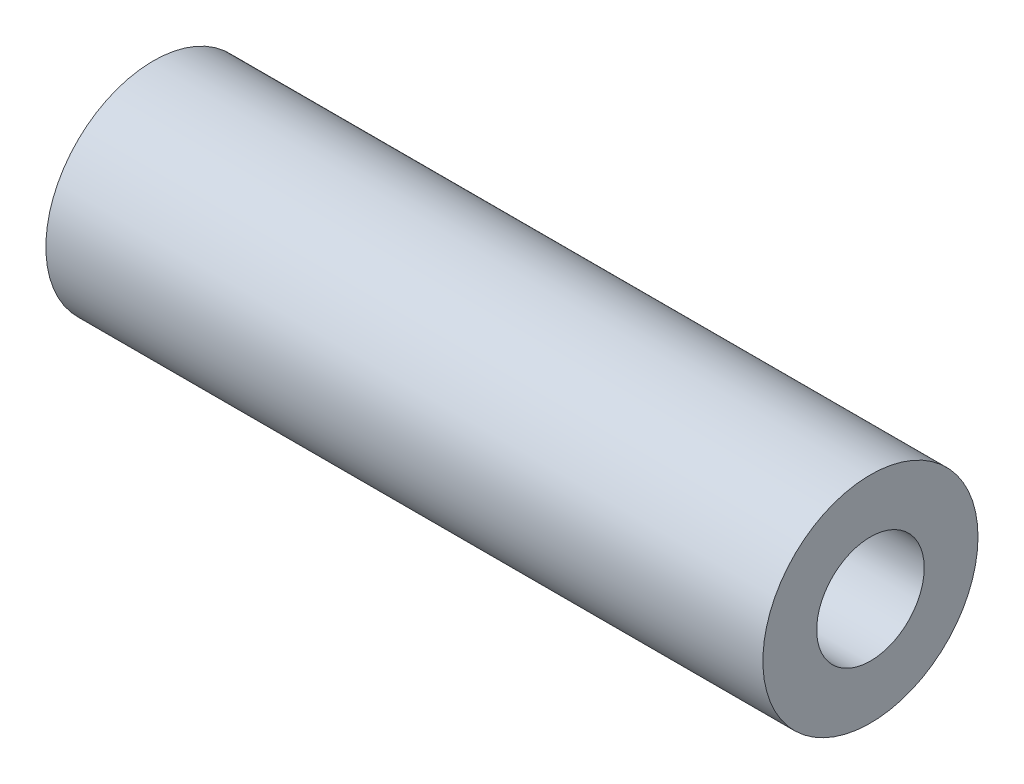
ISO-10303-21;
HEADER;
FILE_DESCRIPTION(('STEP AP214'),'2;1');
FILE_NAME('part.step','',(''),(''),'','','');
FILE_SCHEMA(('AUTOMOTIVE_DESIGN { 1 0 10303 214 1 1 1 1 }'));
ENDSEC;
DATA;
#1=APPLICATION_CONTEXT('core data for automotive mechanical design processes');
#2=APPLICATION_PROTOCOL_DEFINITION('international standard','automotive_design',2000,#1);
#3=PRODUCT_CONTEXT('',#1,'mechanical');
#4=PRODUCT('Part','Part','',(#3));
#5=PRODUCT_RELATED_PRODUCT_CATEGORY('part','',(#4));
#6=PRODUCT_DEFINITION_FORMATION('','',#4);
#7=PRODUCT_DEFINITION_CONTEXT('part definition',#1,'design');
#8=PRODUCT_DEFINITION('design','',#6,#7);
#9=PRODUCT_DEFINITION_SHAPE('','',#8);
#10=(LENGTH_UNIT() NAMED_UNIT(*) SI_UNIT(.MILLI.,.METRE.));
#11=(NAMED_UNIT(*) PLANE_ANGLE_UNIT() SI_UNIT($,.RADIAN.));
#12=(NAMED_UNIT(*) SI_UNIT($,.STERADIAN.) SOLID_ANGLE_UNIT());
#13=UNCERTAINTY_MEASURE_WITH_UNIT(LENGTH_MEASURE(1.E-05),#10,'distance_accuracy_value','');
#14=(GEOMETRIC_REPRESENTATION_CONTEXT(3) GLOBAL_UNCERTAINTY_ASSIGNED_CONTEXT((#13)) GLOBAL_UNIT_ASSIGNED_CONTEXT((#10,
#11,#12)) REPRESENTATION_CONTEXT('',''));
#15=CARTESIAN_POINT('',(0.,0.,0.));
#16=DIRECTION('',(0.,0.,1.));
#17=DIRECTION('',(1.,0.,0.));
#18=AXIS2_PLACEMENT_3D('',#15,#16,#17);
#19=CARTESIAN_POINT('',(63.5,0.,0.));
#20=DIRECTION('',(1.,0.,0.));
#21=DIRECTION('',(0.,0.,-1.));
#22=AXIS2_PLACEMENT_3D('',#19,#20,#21);
#23=PLANE('',#22);
#24=CARTESIAN_POINT('',(63.5,0.,0.));
#25=DIRECTION('',(1.,0.,0.));
#26=DIRECTION('',(0.,0.,-1.));
#27=AXIS2_PLACEMENT_3D('',#24,#25,#26);
#28=CIRCLE('',#27,19.05);
#29=CARTESIAN_POINT('',(63.5,0.,-19.05));
#30=VERTEX_POINT('',#29);
#31=EDGE_CURVE('E10',#30,#30,#28,.T.);
#32=ORIENTED_EDGE('',*,*,#31,.T.);
#33=EDGE_LOOP('',(#32));
#34=FACE_BOUND('',#33,.T.);
#35=CARTESIAN_POINT('',(63.5,0.,0.));
#36=DIRECTION('',(1.,0.,0.));
#37=DIRECTION('',(0.,0.,-1.));
#38=AXIS2_PLACEMENT_3D('',#35,#36,#37);
#39=CIRCLE('',#38,9.525);
#40=CARTESIAN_POINT('',(63.5,0.,-9.525));
#41=VERTEX_POINT('',#40);
#42=EDGE_CURVE('E42',#41,#41,#39,.T.);
#43=ORIENTED_EDGE('',*,*,#42,.F.);
#44=EDGE_LOOP('',(#43));
#45=FACE_BOUND('',#44,.T.);
#46=ADVANCED_FACE('F31',(#34,#45),#23,.T.);
#47=CARTESIAN_POINT('',(-63.5,0.,0.));
#48=DIRECTION('',(1.,0.,0.));
#49=DIRECTION('',(0.,0.,-1.));
#50=AXIS2_PLACEMENT_3D('',#47,#48,#49);
#51=PLANE('',#50);
#52=CARTESIAN_POINT('',(-63.5,0.,0.));
#53=DIRECTION('',(1.,0.,0.));
#54=DIRECTION('',(0.,0.,-1.));
#55=AXIS2_PLACEMENT_3D('',#52,#53,#54);
#56=CIRCLE('',#55,19.05);
#57=CARTESIAN_POINT('',(-63.5,0.,-19.05));
#58=VERTEX_POINT('',#57);
#59=EDGE_CURVE('E35',#58,#58,#56,.T.);
#60=ORIENTED_EDGE('',*,*,#59,.F.);
#61=EDGE_LOOP('',(#60));
#62=FACE_BOUND('',#61,.T.);
#63=CARTESIAN_POINT('',(-63.5,0.,0.));
#64=DIRECTION('',(1.,0.,0.));
#65=DIRECTION('',(0.,0.,-1.));
#66=AXIS2_PLACEMENT_3D('',#63,#64,#65);
#67=CIRCLE('',#66,9.525);
#68=CARTESIAN_POINT('',(-63.5,0.,-9.525));
#69=VERTEX_POINT('',#68);
#70=EDGE_CURVE('E44',#69,#69,#67,.T.);
#71=ORIENTED_EDGE('',*,*,#70,.T.);
#72=EDGE_LOOP('',(#71));
#73=FACE_BOUND('',#72,.T.);
#74=ADVANCED_FACE('F54',(#62,#73),#51,.F.);
#75=CARTESIAN_POINT('',(63.5,0.,0.));
#76=DIRECTION('',(-1.,0.,0.));
#77=DIRECTION('',(0.,0.,1.));
#78=AXIS2_PLACEMENT_3D('',#75,#76,#77);
#79=CYLINDRICAL_SURFACE('',#78,19.05);
#80=ORIENTED_EDGE('',*,*,#31,.F.);
#81=EDGE_LOOP('',(#80));
#82=FACE_BOUND('',#81,.T.);
#83=ORIENTED_EDGE('',*,*,#59,.T.);
#84=EDGE_LOOP('',(#83));
#85=FACE_BOUND('',#84,.T.);
#86=ADVANCED_FACE('F33',(#82,#85),#79,.T.);
#87=CARTESIAN_POINT('',(63.5,0.,0.));
#88=DIRECTION('',(-1.,0.,0.));
#89=DIRECTION('',(0.,0.,1.));
#90=AXIS2_PLACEMENT_3D('',#87,#88,#89);
#91=CYLINDRICAL_SURFACE('',#90,9.525);
#92=ORIENTED_EDGE('',*,*,#42,.T.);
#93=EDGE_LOOP('',(#92));
#94=FACE_BOUND('',#93,.T.);
#95=ORIENTED_EDGE('',*,*,#70,.F.);
#96=EDGE_LOOP('',(#95));
#97=FACE_BOUND('',#96,.T.);
#98=ADVANCED_FACE('F50',(#94,#97),#91,.F.);
#99=CLOSED_SHELL('',(#46,#74,#86,#98));
#100=MANIFOLD_SOLID_BREP('B2',#99);
#101=ADVANCED_BREP_SHAPE_REPRESENTATION('',(#18,#100),#14);
#102=SHAPE_DEFINITION_REPRESENTATION(#9,#101);
ENDSEC;
END-ISO-10303-21;
